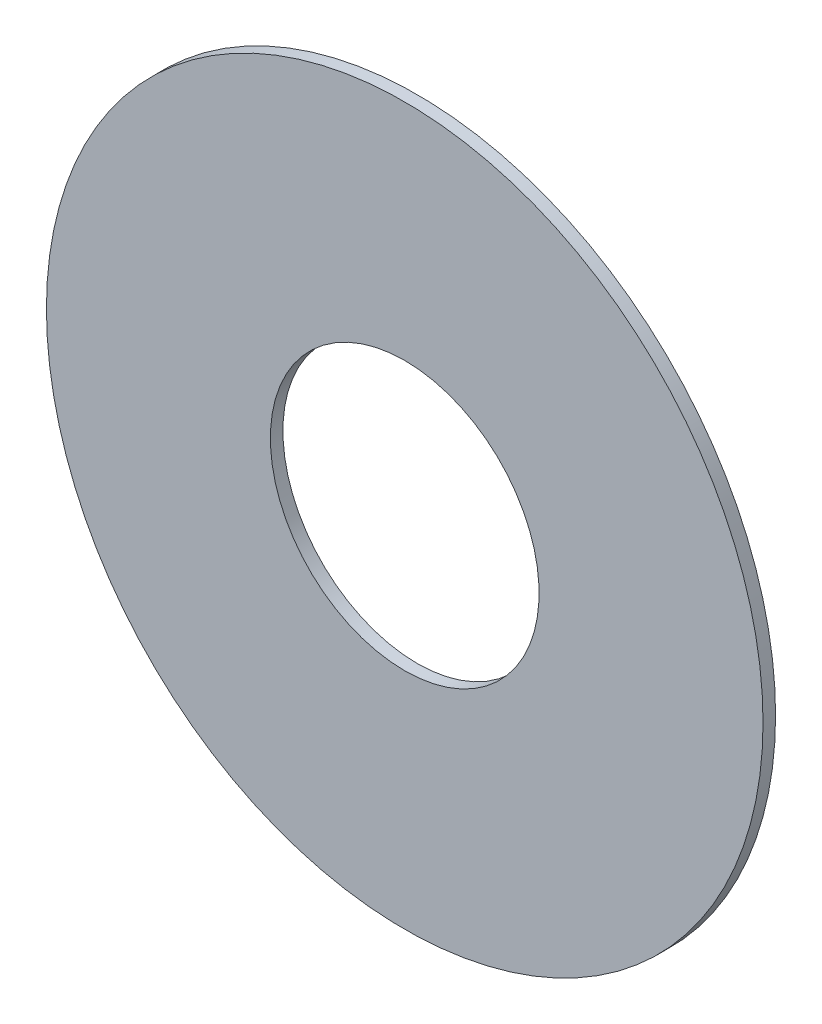
ISO-10303-21;
HEADER;
FILE_DESCRIPTION(('STEP AP214'),'2;1');
FILE_NAME('part.step','',(''),(''),'','','');
FILE_SCHEMA(('AUTOMOTIVE_DESIGN { 1 0 10303 214 1 1 1 1 }'));
ENDSEC;
DATA;
#1=APPLICATION_CONTEXT('core data for automotive mechanical design processes');
#2=APPLICATION_PROTOCOL_DEFINITION('international standard','automotive_design',2000,#1);
#3=PRODUCT_CONTEXT('',#1,'mechanical');
#4=PRODUCT('Part','Part','',(#3));
#5=PRODUCT_RELATED_PRODUCT_CATEGORY('part','',(#4));
#6=PRODUCT_DEFINITION_FORMATION('','',#4);
#7=PRODUCT_DEFINITION_CONTEXT('part definition',#1,'design');
#8=PRODUCT_DEFINITION('design','',#6,#7);
#9=PRODUCT_DEFINITION_SHAPE('','',#8);
#10=(LENGTH_UNIT() NAMED_UNIT(*) SI_UNIT(.MILLI.,.METRE.));
#11=(NAMED_UNIT(*) PLANE_ANGLE_UNIT() SI_UNIT($,.RADIAN.));
#12=(NAMED_UNIT(*) SI_UNIT($,.STERADIAN.) SOLID_ANGLE_UNIT());
#13=UNCERTAINTY_MEASURE_WITH_UNIT(LENGTH_MEASURE(1.E-05),#10,'distance_accuracy_value','');
#14=(GEOMETRIC_REPRESENTATION_CONTEXT(3) GLOBAL_UNCERTAINTY_ASSIGNED_CONTEXT((#13)) GLOBAL_UNIT_ASSIGNED_CONTEXT((#10,
#11,#12)) REPRESENTATION_CONTEXT('',''));
#15=CARTESIAN_POINT('',(0.,0.,0.));
#16=DIRECTION('',(0.,0.,1.));
#17=DIRECTION('',(1.,0.,0.));
#18=AXIS2_PLACEMENT_3D('',#15,#16,#17);
#19=CARTESIAN_POINT('',(141.224,-73.152,-0.045));
#20=DIRECTION('',(0.,0.,-1.));
#21=DIRECTION('',(0.,-1.,0.));
#22=AXIS2_PLACEMENT_3D('',#19,#20,#21);
#23=CYLINDRICAL_SURFACE('',#22,0.375);
#24=CARTESIAN_POINT('',(141.224,-73.152,1.67));
#25=DIRECTION('',(0.,0.,-1.));
#26=DIRECTION('',(0.,-1.,0.));
#27=AXIS2_PLACEMENT_3D('',#24,#25,#26);
#28=CIRCLE('',#27,0.375);
#29=CARTESIAN_POINT('',(141.224,-73.527,1.67));
#30=VERTEX_POINT('',#29);
#31=EDGE_CURVE('E26',#30,#30,#28,.T.);
#32=ORIENTED_EDGE('',*,*,#31,.T.);
#33=DIRECTION('',(0.,0.,1.));
#34=VECTOR('',#33,1.);
#35=CARTESIAN_POINT('',(141.224,-73.527,-0.045));
#36=LINE('',#35,#34);
#37=CARTESIAN_POINT('',(141.224,-73.527,1.705));
#38=VERTEX_POINT('',#37);
#39=EDGE_CURVE('E11',#30,#38,#36,.T.);
#40=ORIENTED_EDGE('',*,*,#39,.T.);
#41=CARTESIAN_POINT('',(141.224,-73.152,1.705));
#42=DIRECTION('',(0.,0.,-1.));
#43=DIRECTION('',(0.,-1.,0.));
#44=AXIS2_PLACEMENT_3D('',#41,#42,#43);
#45=CIRCLE('',#44,0.375);
#46=EDGE_CURVE('E66',#38,#38,#45,.T.);
#47=ORIENTED_EDGE('',*,*,#46,.F.);
#48=ORIENTED_EDGE('',*,*,#39,.F.);
#49=EDGE_LOOP('',(#32,#40,#47,#48));
#50=FACE_BOUND('',#49,.T.);
#51=ADVANCED_FACE('F17',(#50),#23,.F.);
#52=CARTESIAN_POINT('',(141.224,-73.152,1.67));
#53=DIRECTION('',(0.,0.,1.));
#54=DIRECTION('',(1.,0.,0.));
#55=AXIS2_PLACEMENT_3D('',#52,#53,#54);
#56=PLANE('',#55);
#57=ORIENTED_EDGE('',*,*,#31,.F.);
#58=EDGE_LOOP('',(#57));
#59=FACE_BOUND('',#58,.T.);
#60=CARTESIAN_POINT('',(141.224,-73.152,1.67));
#61=DIRECTION('',(0.,0.,1.));
#62=DIRECTION('',(1.,0.,0.));
#63=AXIS2_PLACEMENT_3D('',#60,#61,#62);
#64=CIRCLE('',#63,1.);
#65=CARTESIAN_POINT('',(142.224,-73.152,1.67));
#66=VERTEX_POINT('',#65);
#67=EDGE_CURVE('E53',#66,#66,#64,.T.);
#68=ORIENTED_EDGE('',*,*,#67,.F.);
#69=EDGE_LOOP('',(#68));
#70=FACE_BOUND('',#69,.T.);
#71=ADVANCED_FACE('F74',(#59,#70),#56,.F.);
#72=CARTESIAN_POINT('',(141.224,-73.152,1.705));
#73=DIRECTION('',(0.,0.,1.));
#74=DIRECTION('',(1.,0.,0.));
#75=AXIS2_PLACEMENT_3D('',#72,#73,#74);
#76=PLANE('',#75);
#77=ORIENTED_EDGE('',*,*,#46,.T.);
#78=EDGE_LOOP('',(#77));
#79=FACE_BOUND('',#78,.T.);
#80=CARTESIAN_POINT('',(141.224,-73.152,1.705));
#81=DIRECTION('',(0.,0.,1.));
#82=DIRECTION('',(1.,0.,0.));
#83=AXIS2_PLACEMENT_3D('',#80,#81,#82);
#84=CIRCLE('',#83,1.);
#85=CARTESIAN_POINT('',(142.224,-73.152,1.705));
#86=VERTEX_POINT('',#85);
#87=EDGE_CURVE('E51',#86,#86,#84,.T.);
#88=ORIENTED_EDGE('',*,*,#87,.T.);
#89=EDGE_LOOP('',(#88));
#90=FACE_BOUND('',#89,.T.);
#91=ADVANCED_FACE('F57',(#79,#90),#76,.T.);
#92=CARTESIAN_POINT('',(141.224,-73.152,1.67));
#93=DIRECTION('',(0.,0.,1.));
#94=DIRECTION('',(1.,0.,0.));
#95=AXIS2_PLACEMENT_3D('',#92,#93,#94);
#96=CYLINDRICAL_SURFACE('',#95,1.);
#97=ORIENTED_EDGE('',*,*,#87,.F.);
#98=DIRECTION('',(0.,0.,1.));
#99=VECTOR('',#98,1.);
#100=CARTESIAN_POINT('',(142.224,-73.152,1.67));
#101=LINE('',#100,#99);
#102=EDGE_CURVE('E48',#66,#86,#101,.T.);
#103=ORIENTED_EDGE('',*,*,#102,.F.);
#104=ORIENTED_EDGE('',*,*,#67,.T.);
#105=ORIENTED_EDGE('',*,*,#102,.T.);
#106=EDGE_LOOP('',(#97,#103,#104,#105));
#107=FACE_BOUND('',#106,.T.);
#108=ADVANCED_FACE('F50',(#107),#96,.T.);
#109=CLOSED_SHELL('',(#51,#71,#91,#108));
#110=MANIFOLD_SOLID_BREP('B1',#109);
#111=ADVANCED_BREP_SHAPE_REPRESENTATION('',(#18,#110),#14);
#112=SHAPE_DEFINITION_REPRESENTATION(#9,#111);
ENDSEC;
END-ISO-10303-21;
